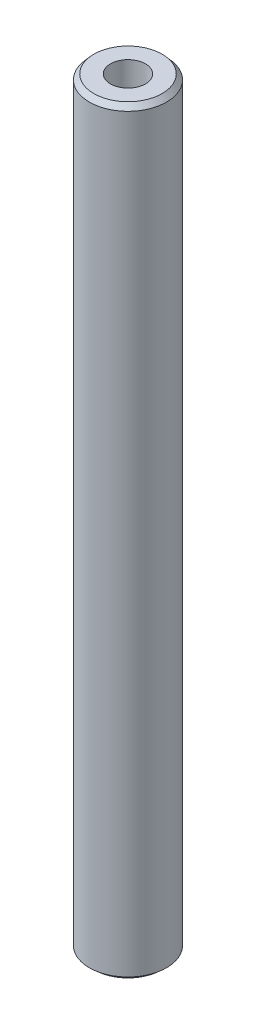
ISO-10303-21;
HEADER;
FILE_DESCRIPTION(('STEP AP214'),'2;1');
FILE_NAME('part.step','',(''),(''),'','','');
FILE_SCHEMA(('AUTOMOTIVE_DESIGN { 1 0 10303 214 1 1 1 1 }'));
ENDSEC;
DATA;
#1=APPLICATION_CONTEXT('core data for automotive mechanical design processes');
#2=APPLICATION_PROTOCOL_DEFINITION('international standard','automotive_design',2000,#1);
#3=PRODUCT_CONTEXT('',#1,'mechanical');
#4=PRODUCT('Part','Part','',(#3));
#5=PRODUCT_RELATED_PRODUCT_CATEGORY('part','',(#4));
#6=PRODUCT_DEFINITION_FORMATION('','',#4);
#7=PRODUCT_DEFINITION_CONTEXT('part definition',#1,'design');
#8=PRODUCT_DEFINITION('design','',#6,#7);
#9=PRODUCT_DEFINITION_SHAPE('','',#8);
#10=(LENGTH_UNIT() NAMED_UNIT(*) SI_UNIT(.MILLI.,.METRE.));
#11=(NAMED_UNIT(*) PLANE_ANGLE_UNIT() SI_UNIT($,.RADIAN.));
#12=(NAMED_UNIT(*) SI_UNIT($,.STERADIAN.) SOLID_ANGLE_UNIT());
#13=UNCERTAINTY_MEASURE_WITH_UNIT(LENGTH_MEASURE(1.E-05),#10,'distance_accuracy_value','');
#14=(GEOMETRIC_REPRESENTATION_CONTEXT(3) GLOBAL_UNCERTAINTY_ASSIGNED_CONTEXT((#13)) GLOBAL_UNIT_ASSIGNED_CONTEXT((#10,
#11,#12)) REPRESENTATION_CONTEXT('',''));
#15=CARTESIAN_POINT('',(0.,0.,0.));
#16=DIRECTION('',(0.,0.,1.));
#17=DIRECTION('',(1.,0.,0.));
#18=AXIS2_PLACEMENT_3D('',#15,#16,#17);
#19=CARTESIAN_POINT('',(0.,98.2792546143311,0.));
#20=DIRECTION('',(0.,-1.,0.));
#21=DIRECTION('',(0.,0.,-1.));
#22=AXIS2_PLACEMENT_3D('',#19,#20,#21);
#23=CYLINDRICAL_SURFACE('',#22,5.);
#24=CARTESIAN_POINT('',(0.,97.6162507131363,0.));
#25=DIRECTION('',(0.,1.,0.));
#26=DIRECTION('',(0.,0.,1.));
#27=AXIS2_PLACEMENT_3D('',#24,#25,#26);
#28=CIRCLE('',#27,5.);
#29=CARTESIAN_POINT('',(0.,97.6162507131363,5.));
#30=VERTEX_POINT('',#29);
#31=EDGE_CURVE('E50',#30,#30,#28,.F.);
#32=ORIENTED_EDGE('',*,*,#31,.T.);
#33=EDGE_LOOP('',(#32));
#34=FACE_BOUND('',#33,.T.);
#35=CARTESIAN_POINT('',(0.,0.580546898352671,0.));
#36=DIRECTION('',(0.,1.,0.));
#37=DIRECTION('',(0.,0.,1.));
#38=AXIS2_PLACEMENT_3D('',#35,#36,#37);
#39=CIRCLE('',#38,5.);
#40=CARTESIAN_POINT('',(0.,0.580546898352671,5.));
#41=VERTEX_POINT('',#40);
#42=EDGE_CURVE('E51',#41,#41,#39,.T.);
#43=ORIENTED_EDGE('',*,*,#42,.T.);
#44=EDGE_LOOP('',(#43));
#45=FACE_BOUND('',#44,.T.);
#46=ADVANCED_FACE('F39',(#34,#45),#23,.T.);
#47=CARTESIAN_POINT('',(0.,98.2792546143311,0.));
#48=DIRECTION('',(0.,1.,0.));
#49=DIRECTION('',(0.,0.,1.));
#50=AXIS2_PLACEMENT_3D('',#47,#48,#49);
#51=PLANE('',#50);
#52=CARTESIAN_POINT('',(0.,98.2792546143311,0.));
#53=DIRECTION('',(0.,1.,0.));
#54=DIRECTION('',(0.,0.,1.));
#55=AXIS2_PLACEMENT_3D('',#52,#53,#54);
#56=CIRCLE('',#55,4.41945310164732);
#57=CARTESIAN_POINT('',(0.,98.2792546143311,4.41945310164732));
#58=VERTEX_POINT('',#57);
#59=EDGE_CURVE('E54',#58,#58,#56,.T.);
#60=ORIENTED_EDGE('',*,*,#59,.T.);
#61=EDGE_LOOP('',(#60));
#62=FACE_BOUND('',#61,.T.);
#63=CARTESIAN_POINT('',(0.,98.2792546143311,0.));
#64=DIRECTION('',(0.,1.,0.));
#65=DIRECTION('',(0.,0.,1.));
#66=AXIS2_PLACEMENT_3D('',#63,#64,#65);
#67=CIRCLE('',#66,2.26112294674608);
#68=CARTESIAN_POINT('',(0.,98.2792546143311,2.26112294674608));
#69=VERTEX_POINT('',#68);
#70=EDGE_CURVE('E58',#69,#69,#67,.T.);
#71=ORIENTED_EDGE('',*,*,#70,.F.);
#72=EDGE_LOOP('',(#71));
#73=FACE_BOUND('',#72,.T.);
#74=ADVANCED_FACE('F69',(#62,#73),#51,.T.);
#75=CARTESIAN_POINT('',(0.,0.,0.));
#76=DIRECTION('',(0.,1.,0.));
#77=DIRECTION('',(0.,0.,1.));
#78=AXIS2_PLACEMENT_3D('',#75,#76,#77);
#79=PLANE('',#78);
#80=CARTESIAN_POINT('',(0.,0.,0.));
#81=DIRECTION('',(0.,1.,0.));
#82=DIRECTION('',(0.,0.,1.));
#83=AXIS2_PLACEMENT_3D('',#80,#81,#82);
#84=CIRCLE('',#83,4.33699609880521);
#85=CARTESIAN_POINT('',(0.,0.,4.33699609880521));
#86=VERTEX_POINT('',#85);
#87=EDGE_CURVE('E10',#86,#86,#84,.F.);
#88=ORIENTED_EDGE('',*,*,#87,.T.);
#89=EDGE_LOOP('',(#88));
#90=FACE_BOUND('',#89,.T.);
#91=CARTESIAN_POINT('',(0.,0.,0.));
#92=DIRECTION('',(0.,1.,0.));
#93=DIRECTION('',(0.,0.,1.));
#94=AXIS2_PLACEMENT_3D('',#91,#92,#93);
#95=CIRCLE('',#94,2.26112294674608);
#96=CARTESIAN_POINT('',(0.,0.,2.26112294674608));
#97=VERTEX_POINT('',#96);
#98=EDGE_CURVE('E63',#97,#97,#95,.T.);
#99=ORIENTED_EDGE('',*,*,#98,.T.);
#100=EDGE_LOOP('',(#99));
#101=FACE_BOUND('',#100,.T.);
#102=ADVANCED_FACE('F75',(#90,#101),#79,.F.);
#103=CARTESIAN_POINT('',(0.,98.2792546143311,0.));
#104=DIRECTION('',(0.,-1.,0.));
#105=DIRECTION('',(0.,0.,-1.));
#106=AXIS2_PLACEMENT_3D('',#103,#104,#105);
#107=CYLINDRICAL_SURFACE('',#106,2.26112294674608);
#108=ORIENTED_EDGE('',*,*,#70,.T.);
#109=EDGE_LOOP('',(#108));
#110=FACE_BOUND('',#109,.T.);
#111=ORIENTED_EDGE('',*,*,#98,.F.);
#112=EDGE_LOOP('',(#111));
#113=FACE_BOUND('',#112,.T.);
#114=ADVANCED_FACE('F70',(#110,#113),#107,.F.);
#115=CARTESIAN_POINT('',(0.,98.2792546143311,0.));
#116=DIRECTION('',(0.,-1.,0.));
#117=DIRECTION('',(0.,0.,-1.));
#118=AXIS2_PLACEMENT_3D('',#115,#116,#117);
#119=CONICAL_SURFACE('',#118,4.41945310164732,0.719187378841078);
#120=ORIENTED_EDGE('',*,*,#31,.F.);
#121=EDGE_LOOP('',(#120));
#122=FACE_BOUND('',#121,.T.);
#123=ORIENTED_EDGE('',*,*,#59,.F.);
#124=EDGE_LOOP('',(#123));
#125=FACE_BOUND('',#124,.T.);
#126=ADVANCED_FACE('F81',(#122,#125),#119,.T.);
#127=CARTESIAN_POINT('',(0.,0.580546898352671,0.));
#128=DIRECTION('',(0.,1.,0.));
#129=DIRECTION('',(0.,0.,1.));
#130=AXIS2_PLACEMENT_3D('',#127,#128,#129);
#131=CONICAL_SURFACE('',#130,5.,0.851608947953824);
#132=ORIENTED_EDGE('',*,*,#87,.F.);
#133=EDGE_LOOP('',(#132));
#134=FACE_BOUND('',#133,.T.);
#135=ORIENTED_EDGE('',*,*,#42,.F.);
#136=EDGE_LOOP('',(#135));
#137=FACE_BOUND('',#136,.T.);
#138=ADVANCED_FACE('F45',(#134,#137),#131,.T.);
#139=CLOSED_SHELL('',(#46,#74,#102,#114,#126,#138));
#140=MANIFOLD_SOLID_BREP('B2',#139);
#141=ADVANCED_BREP_SHAPE_REPRESENTATION('',(#18,#140),#14);
#142=SHAPE_DEFINITION_REPRESENTATION(#9,#141);
ENDSEC;
END-ISO-10303-21;
